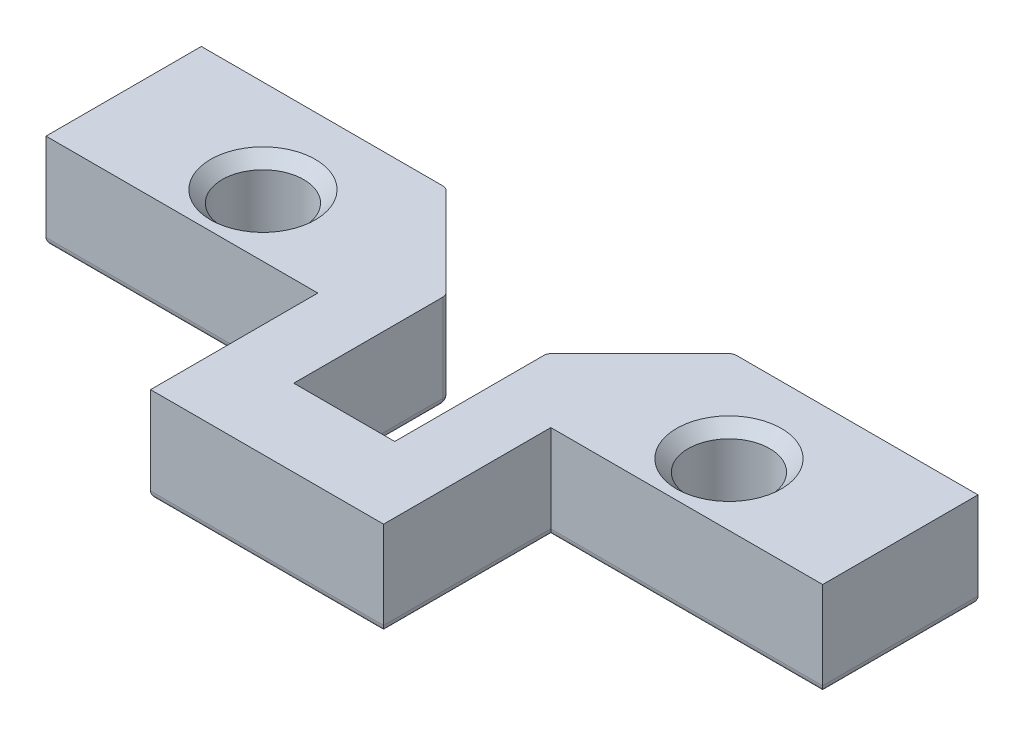
ISO-10303-21;
HEADER;
FILE_DESCRIPTION(('STEP AP214'),'2;1');
FILE_NAME('part.step','',(''),(''),'','','');
FILE_SCHEMA(('AUTOMOTIVE_DESIGN { 1 0 10303 214 1 1 1 1 }'));
ENDSEC;
DATA;
#1=APPLICATION_CONTEXT('core data for automotive mechanical design processes');
#2=APPLICATION_PROTOCOL_DEFINITION('international standard','automotive_design',2000,#1);
#3=PRODUCT_CONTEXT('',#1,'mechanical');
#4=PRODUCT('Part','Part','',(#3));
#5=PRODUCT_RELATED_PRODUCT_CATEGORY('part','',(#4));
#6=PRODUCT_DEFINITION_FORMATION('','',#4);
#7=PRODUCT_DEFINITION_CONTEXT('part definition',#1,'design');
#8=PRODUCT_DEFINITION('design','',#6,#7);
#9=PRODUCT_DEFINITION_SHAPE('','',#8);
#10=(LENGTH_UNIT() NAMED_UNIT(*) SI_UNIT(.MILLI.,.METRE.));
#11=(NAMED_UNIT(*) PLANE_ANGLE_UNIT() SI_UNIT($,.RADIAN.));
#12=(NAMED_UNIT(*) SI_UNIT($,.STERADIAN.) SOLID_ANGLE_UNIT());
#13=UNCERTAINTY_MEASURE_WITH_UNIT(LENGTH_MEASURE(1.E-05),#10,'distance_accuracy_value','');
#14=(GEOMETRIC_REPRESENTATION_CONTEXT(3) GLOBAL_UNCERTAINTY_ASSIGNED_CONTEXT((#13)) GLOBAL_UNIT_ASSIGNED_CONTEXT((#10,
#11,#12)) REPRESENTATION_CONTEXT('',''));
#15=CARTESIAN_POINT('',(0.,0.,0.));
#16=DIRECTION('',(0.,0.,1.));
#17=DIRECTION('',(1.,0.,0.));
#18=AXIS2_PLACEMENT_3D('',#15,#16,#17);
#19=CARTESIAN_POINT('',(-6.5,12.3,0.));
#20=DIRECTION('',(1.,0.,0.));
#21=DIRECTION('',(0.,0.,-1.));
#22=AXIS2_PLACEMENT_3D('',#19,#20,#21);
#23=PLANE('',#22);
#24=DIRECTION('',(0.,-1.,0.));
#25=VECTOR('',#24,1.);
#26=CARTESIAN_POINT('',(-6.5,12.3,21.6));
#27=LINE('',#26,#25);
#28=CARTESIAN_POINT('',(-6.5,12.3,21.6));
#29=VERTEX_POINT('',#28);
#30=CARTESIAN_POINT('',(-6.5,0.999999999999999,21.6));
#31=VERTEX_POINT('',#30);
#32=EDGE_CURVE('E286',#29,#31,#27,.T.);
#33=ORIENTED_EDGE('',*,*,#32,.T.);
#34=DIRECTION('',(0.,0.,1.));
#35=VECTOR('',#34,1.);
#36=CARTESIAN_POINT('',(-6.5,1.,2.00000000000003));
#37=LINE('',#36,#35);
#38=CARTESIAN_POINT('',(-6.5,1.,2.41421356237312));
#39=VERTEX_POINT('',#38);
#40=EDGE_CURVE('E401',#31,#39,#37,.F.);
#41=ORIENTED_EDGE('',*,*,#40,.T.);
#42=DIRECTION('',(0.,-1.,0.));
#43=VECTOR('',#42,1.);
#44=CARTESIAN_POINT('',(-6.5,12.3,2.41421356237312));
#45=LINE('',#44,#43);
#46=CARTESIAN_POINT('',(-6.5,12.3,2.41421356237312));
#47=VERTEX_POINT('',#46);
#48=EDGE_CURVE('E398',#39,#47,#45,.F.);
#49=ORIENTED_EDGE('',*,*,#48,.T.);
#50=DIRECTION('',(0.,0.,1.));
#51=VECTOR('',#50,1.);
#52=CARTESIAN_POINT('',(-6.5,12.3,0.));
#53=LINE('',#52,#51);
#54=EDGE_CURVE('E245',#47,#29,#53,.T.);
#55=ORIENTED_EDGE('',*,*,#54,.T.);
#56=EDGE_LOOP('',(#33,#41,#49,#55));
#57=FACE_BOUND('',#56,.T.);
#58=ADVANCED_FACE('F51',(#57),#23,.T.);
#59=CARTESIAN_POINT('',(0.,12.3,-10.));
#60=DIRECTION('',(0.,0.,-1.));
#61=DIRECTION('',(-1.,0.,0.));
#62=AXIS2_PLACEMENT_3D('',#59,#60,#61);
#63=PLANE('',#62);
#64=DIRECTION('',(0.,1.,0.));
#65=VECTOR('',#64,1.);
#66=CARTESIAN_POINT('',(-18.9142135623731,12.3,-10.));
#67=LINE('',#66,#65);
#68=CARTESIAN_POINT('',(-18.9142135623731,12.3,-10.));
#69=VERTEX_POINT('',#68);
#70=CARTESIAN_POINT('',(-18.9142135623731,1.,-10.));
#71=VERTEX_POINT('',#70);
#72=EDGE_CURVE('E422',#69,#71,#67,.F.);
#73=ORIENTED_EDGE('',*,*,#72,.T.);
#74=DIRECTION('',(1.,0.,0.));
#75=VECTOR('',#74,1.);
#76=CARTESIAN_POINT('',(-50.,1.,-10.));
#77=LINE('',#76,#75);
#78=CARTESIAN_POINT('',(-50.,0.999999999999999,-10.));
#79=VERTEX_POINT('',#78);
#80=EDGE_CURVE('E228',#71,#79,#77,.F.);
#81=ORIENTED_EDGE('',*,*,#80,.T.);
#82=DIRECTION('',(0.,-1.,0.));
#83=VECTOR('',#82,1.);
#84=CARTESIAN_POINT('',(-50.,12.3,-10.));
#85=LINE('',#84,#83);
#86=CARTESIAN_POINT('',(-50.,12.3,-10.));
#87=VERTEX_POINT('',#86);
#88=EDGE_CURVE('E222',#87,#79,#85,.T.);
#89=ORIENTED_EDGE('',*,*,#88,.F.);
#90=DIRECTION('',(1.,0.,0.));
#91=VECTOR('',#90,1.);
#92=CARTESIAN_POINT('',(0.,12.3,-10.));
#93=LINE('',#92,#91);
#94=EDGE_CURVE('E225',#87,#69,#93,.T.);
#95=ORIENTED_EDGE('',*,*,#94,.T.);
#96=EDGE_LOOP('',(#73,#81,#89,#95));
#97=FACE_BOUND('',#96,.T.);
#98=ADVANCED_FACE('F224',(#97),#63,.T.);
#99=CARTESIAN_POINT('',(-50.,12.3,0.));
#100=DIRECTION('',(-1.,0.,0.));
#101=DIRECTION('',(0.,0.,1.));
#102=AXIS2_PLACEMENT_3D('',#99,#100,#101);
#103=PLANE('',#102);
#104=ORIENTED_EDGE('',*,*,#88,.T.);
#105=DIRECTION('',(0.,0.,-1.));
#106=VECTOR('',#105,1.);
#107=CARTESIAN_POINT('',(-50.,1.,10.));
#108=LINE('',#107,#106);
#109=CARTESIAN_POINT('',(-50.,0.999999999999999,10.));
#110=VERTEX_POINT('',#109);
#111=EDGE_CURVE('E427',#79,#110,#108,.F.);
#112=ORIENTED_EDGE('',*,*,#111,.T.);
#113=DIRECTION('',(0.,-1.,0.));
#114=VECTOR('',#113,1.);
#115=CARTESIAN_POINT('',(-50.,12.3,10.));
#116=LINE('',#115,#114);
#117=CARTESIAN_POINT('',(-50.,12.3,10.));
#118=VERTEX_POINT('',#117);
#119=EDGE_CURVE('E234',#118,#110,#116,.T.);
#120=ORIENTED_EDGE('',*,*,#119,.F.);
#121=DIRECTION('',(0.,0.,-1.));
#122=VECTOR('',#121,1.);
#123=CARTESIAN_POINT('',(-50.,12.3,0.));
#124=LINE('',#123,#122);
#125=EDGE_CURVE('E241',#118,#87,#124,.T.);
#126=ORIENTED_EDGE('',*,*,#125,.T.);
#127=EDGE_LOOP('',(#104,#112,#120,#126));
#128=FACE_BOUND('',#127,.T.);
#129=ADVANCED_FACE('F247',(#128),#103,.T.);
#130=CARTESIAN_POINT('',(0.,12.3,10.));
#131=DIRECTION('',(0.,0.,-1.));
#132=DIRECTION('',(-1.,0.,0.));
#133=AXIS2_PLACEMENT_3D('',#130,#131,#132);
#134=PLANE('',#133);
#135=ORIENTED_EDGE('',*,*,#119,.T.);
#136=DIRECTION('',(1.,0.,0.));
#137=VECTOR('',#136,1.);
#138=CARTESIAN_POINT('',(0.,0.999999999999999,10.));
#139=LINE('',#138,#137);
#140=CARTESIAN_POINT('',(-15.,0.999999999999999,10.));
#141=VERTEX_POINT('',#140);
#142=EDGE_CURVE('E430',#110,#141,#139,.T.);
#143=ORIENTED_EDGE('',*,*,#142,.T.);
#144=DIRECTION('',(0.,-1.,0.));
#145=VECTOR('',#144,1.);
#146=CARTESIAN_POINT('',(-15.,12.3,10.));
#147=LINE('',#146,#145);
#148=CARTESIAN_POINT('',(-15.,12.3,10.));
#149=VERTEX_POINT('',#148);
#150=EDGE_CURVE('E323',#149,#141,#147,.T.);
#151=ORIENTED_EDGE('',*,*,#150,.F.);
#152=DIRECTION('',(1.,0.,0.));
#153=VECTOR('',#152,1.);
#154=CARTESIAN_POINT('',(0.,12.3,10.));
#155=LINE('',#154,#153);
#156=EDGE_CURVE('E251',#118,#149,#155,.T.);
#157=ORIENTED_EDGE('',*,*,#156,.F.);
#158=EDGE_LOOP('',(#135,#143,#151,#157));
#159=FACE_BOUND('',#158,.T.);
#160=ADVANCED_FACE('F576',(#159),#134,.F.);
#161=CARTESIAN_POINT('',(-15.,12.3,0.));
#162=DIRECTION('',(1.,0.,0.));
#163=DIRECTION('',(0.,0.,-1.));
#164=AXIS2_PLACEMENT_3D('',#161,#162,#163);
#165=PLANE('',#164);
#166=ORIENTED_EDGE('',*,*,#150,.T.);
#167=DIRECTION('',(0.,0.,1.));
#168=VECTOR('',#167,1.);
#169=CARTESIAN_POINT('',(-15.,0.999999999999999,0.));
#170=LINE('',#169,#168);
#171=CARTESIAN_POINT('',(-15.,0.999999999999999,31.53738907));
#172=VERTEX_POINT('',#171);
#173=EDGE_CURVE('E433',#141,#172,#170,.T.);
#174=ORIENTED_EDGE('',*,*,#173,.T.);
#175=DIRECTION('',(0.,-1.,0.));
#176=VECTOR('',#175,1.);
#177=CARTESIAN_POINT('',(-15.,12.3,31.53738907));
#178=LINE('',#177,#176);
#179=CARTESIAN_POINT('',(-15.,12.3,31.53738907));
#180=VERTEX_POINT('',#179);
#181=EDGE_CURVE('E319',#180,#172,#178,.T.);
#182=ORIENTED_EDGE('',*,*,#181,.F.);
#183=DIRECTION('',(0.,0.,1.));
#184=VECTOR('',#183,1.);
#185=CARTESIAN_POINT('',(-15.,12.3,0.));
#186=LINE('',#185,#184);
#187=EDGE_CURVE('E254',#149,#180,#186,.T.);
#188=ORIENTED_EDGE('',*,*,#187,.F.);
#189=EDGE_LOOP('',(#166,#174,#182,#188));
#190=FACE_BOUND('',#189,.T.);
#191=ADVANCED_FACE('F582',(#190),#165,.F.);
#192=CARTESIAN_POINT('',(0.,12.3,31.53738907));
#193=DIRECTION('',(0.,0.,1.));
#194=DIRECTION('',(1.,0.,0.));
#195=AXIS2_PLACEMENT_3D('',#192,#193,#194);
#196=PLANE('',#195);
#197=ORIENTED_EDGE('',*,*,#181,.T.);
#198=DIRECTION('',(-1.,0.,0.));
#199=VECTOR('',#198,1.);
#200=CARTESIAN_POINT('',(15.,1.,31.53738907));
#201=LINE('',#200,#199);
#202=CARTESIAN_POINT('',(15.,0.999999999999999,31.53738907));
#203=VERTEX_POINT('',#202);
#204=EDGE_CURVE('E436',#172,#203,#201,.F.);
#205=ORIENTED_EDGE('',*,*,#204,.T.);
#206=DIRECTION('',(0.,-1.,0.));
#207=VECTOR('',#206,1.);
#208=CARTESIAN_POINT('',(15.,12.3,31.53738907));
#209=LINE('',#208,#207);
#210=CARTESIAN_POINT('',(15.,12.3,31.53738907));
#211=VERTEX_POINT('',#210);
#212=EDGE_CURVE('E315',#211,#203,#209,.T.);
#213=ORIENTED_EDGE('',*,*,#212,.F.);
#214=DIRECTION('',(-1.,0.,0.));
#215=VECTOR('',#214,1.);
#216=CARTESIAN_POINT('',(0.,12.3,31.53738907));
#217=LINE('',#216,#215);
#218=EDGE_CURVE('E260',#211,#180,#217,.T.);
#219=ORIENTED_EDGE('',*,*,#218,.T.);
#220=EDGE_LOOP('',(#197,#205,#213,#219));
#221=FACE_BOUND('',#220,.T.);
#222=ADVANCED_FACE('F586',(#221),#196,.T.);
#223=CARTESIAN_POINT('',(15.,12.3,0.));
#224=DIRECTION('',(1.,0.,0.));
#225=DIRECTION('',(0.,0.,-1.));
#226=AXIS2_PLACEMENT_3D('',#223,#224,#225);
#227=PLANE('',#226);
#228=ORIENTED_EDGE('',*,*,#212,.T.);
#229=DIRECTION('',(0.,0.,1.));
#230=VECTOR('',#229,1.);
#231=CARTESIAN_POINT('',(15.,1.,10.));
#232=LINE('',#231,#230);
#233=CARTESIAN_POINT('',(15.,0.999999999999999,10.));
#234=VERTEX_POINT('',#233);
#235=EDGE_CURVE('E439',#203,#234,#232,.F.);
#236=ORIENTED_EDGE('',*,*,#235,.T.);
#237=DIRECTION('',(0.,-1.,0.));
#238=VECTOR('',#237,1.);
#239=CARTESIAN_POINT('',(15.,12.3,10.));
#240=LINE('',#239,#238);
#241=CARTESIAN_POINT('',(15.,12.3,10.));
#242=VERTEX_POINT('',#241);
#243=EDGE_CURVE('E311',#242,#234,#240,.T.);
#244=ORIENTED_EDGE('',*,*,#243,.F.);
#245=DIRECTION('',(0.,0.,1.));
#246=VECTOR('',#245,1.);
#247=CARTESIAN_POINT('',(15.,12.3,0.));
#248=LINE('',#247,#246);
#249=EDGE_CURVE('E264',#242,#211,#248,.T.);
#250=ORIENTED_EDGE('',*,*,#249,.T.);
#251=EDGE_LOOP('',(#228,#236,#244,#250));
#252=FACE_BOUND('',#251,.T.);
#253=ADVANCED_FACE('F590',(#252),#227,.T.);
#254=CARTESIAN_POINT('',(0.,12.3,10.));
#255=DIRECTION('',(0.,0.,-1.));
#256=DIRECTION('',(-1.,0.,0.));
#257=AXIS2_PLACEMENT_3D('',#254,#255,#256);
#258=PLANE('',#257);
#259=ORIENTED_EDGE('',*,*,#243,.T.);
#260=DIRECTION('',(1.,0.,0.));
#261=VECTOR('',#260,1.);
#262=CARTESIAN_POINT('',(0.,0.999999999999999,10.));
#263=LINE('',#262,#261);
#264=CARTESIAN_POINT('',(50.,0.999999999999999,10.));
#265=VERTEX_POINT('',#264);
#266=EDGE_CURVE('E442',#234,#265,#263,.T.);
#267=ORIENTED_EDGE('',*,*,#266,.T.);
#268=DIRECTION('',(0.,-1.,0.));
#269=VECTOR('',#268,1.);
#270=CARTESIAN_POINT('',(50.,12.3,10.));
#271=LINE('',#270,#269);
#272=CARTESIAN_POINT('',(50.,12.3,10.));
#273=VERTEX_POINT('',#272);
#274=EDGE_CURVE('E308',#273,#265,#271,.T.);
#275=ORIENTED_EDGE('',*,*,#274,.F.);
#276=DIRECTION('',(1.,0.,0.));
#277=VECTOR('',#276,1.);
#278=CARTESIAN_POINT('',(0.,12.3,10.));
#279=LINE('',#278,#277);
#280=EDGE_CURVE('E268',#242,#273,#279,.T.);
#281=ORIENTED_EDGE('',*,*,#280,.F.);
#282=EDGE_LOOP('',(#259,#267,#275,#281));
#283=FACE_BOUND('',#282,.T.);
#284=ADVANCED_FACE('F606',(#283),#258,.F.);
#285=CARTESIAN_POINT('',(50.,12.3,0.));
#286=DIRECTION('',(-1.,0.,0.));
#287=DIRECTION('',(0.,0.,1.));
#288=AXIS2_PLACEMENT_3D('',#285,#286,#287);
#289=PLANE('',#288);
#290=ORIENTED_EDGE('',*,*,#274,.T.);
#291=DIRECTION('',(0.,0.,-1.));
#292=VECTOR('',#291,1.);
#293=CARTESIAN_POINT('',(50.,0.999999999999999,0.));
#294=LINE('',#293,#292);
#295=CARTESIAN_POINT('',(50.,0.999999999999999,-10.));
#296=VERTEX_POINT('',#295);
#297=EDGE_CURVE('E77',#265,#296,#294,.T.);
#298=ORIENTED_EDGE('',*,*,#297,.T.);
#299=DIRECTION('',(0.,-1.,0.));
#300=VECTOR('',#299,1.);
#301=CARTESIAN_POINT('',(50.,12.3,-10.));
#302=LINE('',#301,#300);
#303=CARTESIAN_POINT('',(50.,12.3,-10.));
#304=VERTEX_POINT('',#303);
#305=EDGE_CURVE('E305',#304,#296,#302,.T.);
#306=ORIENTED_EDGE('',*,*,#305,.F.);
#307=DIRECTION('',(0.,0.,-1.));
#308=VECTOR('',#307,1.);
#309=CARTESIAN_POINT('',(50.,12.3,0.));
#310=LINE('',#309,#308);
#311=EDGE_CURVE('E272',#273,#304,#310,.T.);
#312=ORIENTED_EDGE('',*,*,#311,.F.);
#313=EDGE_LOOP('',(#290,#298,#306,#312));
#314=FACE_BOUND('',#313,.T.);
#315=ADVANCED_FACE('F608',(#314),#289,.F.);
#316=CARTESIAN_POINT('',(0.,12.3,-10.));
#317=DIRECTION('',(0.,0.,-1.));
#318=DIRECTION('',(-1.,0.,0.));
#319=AXIS2_PLACEMENT_3D('',#316,#317,#318);
#320=PLANE('',#319);
#321=DIRECTION('',(1.,0.,0.));
#322=VECTOR('',#321,1.);
#323=CARTESIAN_POINT('',(18.5,1.,-10.));
#324=LINE('',#323,#322);
#325=CARTESIAN_POINT('',(18.9142135623731,1.,-10.));
#326=VERTEX_POINT('',#325);
#327=EDGE_CURVE('E69',#296,#326,#324,.F.);
#328=ORIENTED_EDGE('',*,*,#327,.T.);
#329=DIRECTION('',(0.,1.,0.));
#330=VECTOR('',#329,1.);
#331=CARTESIAN_POINT('',(18.9142135623731,12.3,-10.));
#332=LINE('',#331,#330);
#333=CARTESIAN_POINT('',(18.9142135623731,12.3,-10.));
#334=VERTEX_POINT('',#333);
#335=EDGE_CURVE('E458',#326,#334,#332,.T.);
#336=ORIENTED_EDGE('',*,*,#335,.T.);
#337=DIRECTION('',(1.,0.,0.));
#338=VECTOR('',#337,1.);
#339=CARTESIAN_POINT('',(0.,12.3,-10.));
#340=LINE('',#339,#338);
#341=EDGE_CURVE('E276',#334,#304,#340,.T.);
#342=ORIENTED_EDGE('',*,*,#341,.T.);
#343=ORIENTED_EDGE('',*,*,#305,.T.);
#344=EDGE_LOOP('',(#328,#336,#342,#343));
#345=FACE_BOUND('',#344,.T.);
#346=ADVANCED_FACE('F925',(#345),#320,.T.);
#347=CARTESIAN_POINT('',(6.5,12.3,0.));
#348=DIRECTION('',(1.,0.,0.));
#349=DIRECTION('',(0.,0.,-1.));
#350=AXIS2_PLACEMENT_3D('',#347,#348,#349);
#351=PLANE('',#350);
#352=DIRECTION('',(0.,-1.,0.));
#353=VECTOR('',#352,1.);
#354=CARTESIAN_POINT('',(6.5,0.,2.41421356237308));
#355=LINE('',#354,#353);
#356=CARTESIAN_POINT('',(6.5,12.3,2.41421356237308));
#357=VERTEX_POINT('',#356);
#358=CARTESIAN_POINT('',(6.5,0.999999999999999,2.41421356237308));
#359=VERTEX_POINT('',#358);
#360=EDGE_CURVE('E351',#357,#359,#355,.T.);
#361=ORIENTED_EDGE('',*,*,#360,.T.);
#362=DIRECTION('',(0.,0.,1.));
#363=VECTOR('',#362,1.);
#364=CARTESIAN_POINT('',(6.5,0.999999999999999,0.));
#365=LINE('',#364,#363);
#366=CARTESIAN_POINT('',(6.5,0.999999999999999,21.6));
#367=VERTEX_POINT('',#366);
#368=EDGE_CURVE('E354',#359,#367,#365,.T.);
#369=ORIENTED_EDGE('',*,*,#368,.T.);
#370=DIRECTION('',(0.,-1.,0.));
#371=VECTOR('',#370,1.);
#372=CARTESIAN_POINT('',(6.5,12.3,21.6));
#373=LINE('',#372,#371);
#374=CARTESIAN_POINT('',(6.5,12.3,21.6));
#375=VERTEX_POINT('',#374);
#376=EDGE_CURVE('E301',#375,#367,#373,.T.);
#377=ORIENTED_EDGE('',*,*,#376,.F.);
#378=DIRECTION('',(0.,0.,1.));
#379=VECTOR('',#378,1.);
#380=CARTESIAN_POINT('',(6.5,12.3,0.));
#381=LINE('',#380,#379);
#382=EDGE_CURVE('E279',#357,#375,#381,.T.);
#383=ORIENTED_EDGE('',*,*,#382,.F.);
#384=EDGE_LOOP('',(#361,#369,#377,#383));
#385=FACE_BOUND('',#384,.T.);
#386=ADVANCED_FACE('F631',(#385),#351,.F.);
#387=CARTESIAN_POINT('',(0.,12.3,21.6));
#388=DIRECTION('',(0.,0.,-1.));
#389=DIRECTION('',(-1.,0.,0.));
#390=AXIS2_PLACEMENT_3D('',#387,#388,#389);
#391=PLANE('',#390);
#392=DIRECTION('',(1.,0.,0.));
#393=VECTOR('',#392,1.);
#394=CARTESIAN_POINT('',(0.,0.,21.6));
#395=LINE('',#394,#393);
#396=CARTESIAN_POINT('',(-7.5,0.,21.6));
#397=VERTEX_POINT('',#396);
#398=CARTESIAN_POINT('',(7.5,0.,21.6));
#399=VERTEX_POINT('',#398);
#400=EDGE_CURVE('E291',#397,#399,#395,.T.);
#401=ORIENTED_EDGE('',*,*,#400,.F.);
#402=CARTESIAN_POINT('',(-7.5,1.,21.6));
#403=DIRECTION('',(0.,0.,-1.));
#404=DIRECTION('',(-1.,0.,0.));
#405=AXIS2_PLACEMENT_3D('',#402,#403,#404);
#406=CIRCLE('',#405,1.);
#407=EDGE_CURVE('E11',#397,#31,#406,.F.);
#408=ORIENTED_EDGE('',*,*,#407,.T.);
#409=ORIENTED_EDGE('',*,*,#32,.F.);
#410=DIRECTION('',(1.,0.,0.));
#411=VECTOR('',#410,1.);
#412=CARTESIAN_POINT('',(0.,12.3,21.6));
#413=LINE('',#412,#411);
#414=EDGE_CURVE('E282',#29,#375,#413,.T.);
#415=ORIENTED_EDGE('',*,*,#414,.T.);
#416=ORIENTED_EDGE('',*,*,#376,.T.);
#417=CARTESIAN_POINT('',(7.5,0.999999999999999,21.6));
#418=DIRECTION('',(0.,0.,-1.));
#419=DIRECTION('',(-1.,0.,0.));
#420=AXIS2_PLACEMENT_3D('',#417,#418,#419);
#421=CIRCLE('',#420,1.);
#422=EDGE_CURVE('E61',#367,#399,#421,.F.);
#423=ORIENTED_EDGE('',*,*,#422,.T.);
#424=EDGE_LOOP('',(#401,#408,#409,#415,#416,#423));
#425=FACE_BOUND('',#424,.T.);
#426=ADVANCED_FACE('F639',(#425),#391,.T.);
#427=CARTESIAN_POINT('',(-30.0667409058085,12.3,2.));
#428=DIRECTION('',(0.,-1.,0.));
#429=DIRECTION('',(0.,0.,-1.));
#430=AXIS2_PLACEMENT_3D('',#427,#428,#429);
#431=CYLINDRICAL_SURFACE('',#430,5.25);
#432=CARTESIAN_POINT('',(-30.0667409058085,10.8,2.));
#433=DIRECTION('',(0.,1.,0.));
#434=DIRECTION('',(0.,0.,1.));
#435=AXIS2_PLACEMENT_3D('',#432,#433,#434);
#436=CIRCLE('',#435,5.25);
#437=CARTESIAN_POINT('',(-30.0667409058085,10.8,7.25));
#438=VERTEX_POINT('',#437);
#439=EDGE_CURVE('E340',#438,#438,#436,.T.);
#440=ORIENTED_EDGE('',*,*,#439,.T.);
#441=EDGE_LOOP('',(#440));
#442=FACE_BOUND('',#441,.T.);
#443=CARTESIAN_POINT('',(-30.0667409058085,0.,2.));
#444=DIRECTION('',(0.,1.,0.));
#445=DIRECTION('',(0.,0.,1.));
#446=AXIS2_PLACEMENT_3D('',#443,#444,#445);
#447=CIRCLE('',#446,5.25);
#448=CARTESIAN_POINT('',(-30.0667409058085,0.,7.25));
#449=VERTEX_POINT('',#448);
#450=EDGE_CURVE('E287',#449,#449,#447,.T.);
#451=ORIENTED_EDGE('',*,*,#450,.F.);
#452=EDGE_LOOP('',(#451));
#453=FACE_BOUND('',#452,.T.);
#454=ADVANCED_FACE('F686',(#442,#453),#431,.F.);
#455=CARTESIAN_POINT('',(29.9332590941915,12.3,2.));
#456=DIRECTION('',(0.,-1.,0.));
#457=DIRECTION('',(0.,0.,-1.));
#458=AXIS2_PLACEMENT_3D('',#455,#456,#457);
#459=CYLINDRICAL_SURFACE('',#458,5.25);
#460=CARTESIAN_POINT('',(29.9332590941915,10.8,2.));
#461=DIRECTION('',(0.,1.,0.));
#462=DIRECTION('',(0.,0.,1.));
#463=AXIS2_PLACEMENT_3D('',#460,#461,#462);
#464=CIRCLE('',#463,5.25);
#465=CARTESIAN_POINT('',(29.9332590941915,10.8,7.25));
#466=VERTEX_POINT('',#465);
#467=EDGE_CURVE('E233',#466,#466,#464,.T.);
#468=ORIENTED_EDGE('',*,*,#467,.T.);
#469=EDGE_LOOP('',(#468));
#470=FACE_BOUND('',#469,.T.);
#471=CARTESIAN_POINT('',(29.9332590941915,0.,2.));
#472=DIRECTION('',(0.,1.,0.));
#473=DIRECTION('',(0.,0.,1.));
#474=AXIS2_PLACEMENT_3D('',#471,#472,#473);
#475=CIRCLE('',#474,5.25);
#476=CARTESIAN_POINT('',(29.9332590941915,0.,7.25));
#477=VERTEX_POINT('',#476);
#478=EDGE_CURVE('E294',#477,#477,#475,.T.);
#479=ORIENTED_EDGE('',*,*,#478,.F.);
#480=EDGE_LOOP('',(#479));
#481=FACE_BOUND('',#480,.T.);
#482=ADVANCED_FACE('F689',(#470,#481),#459,.F.);
#483=CARTESIAN_POINT('',(0.,12.3,0.));
#484=DIRECTION('',(0.,1.,0.));
#485=DIRECTION('',(0.,0.,1.));
#486=AXIS2_PLACEMENT_3D('',#483,#484,#485);
#487=PLANE('',#486);
#488=CARTESIAN_POINT('',(29.9332590941915,12.3,2.));
#489=DIRECTION('',(0.,1.,0.));
#490=DIRECTION('',(0.,0.,1.));
#491=AXIS2_PLACEMENT_3D('',#488,#489,#490);
#492=CIRCLE('',#491,6.75000000000001);
#493=CARTESIAN_POINT('',(29.9332590941915,12.3,8.75));
#494=VERTEX_POINT('',#493);
#495=EDGE_CURVE('E336',#494,#494,#492,.F.);
#496=ORIENTED_EDGE('',*,*,#495,.T.);
#497=EDGE_LOOP('',(#496));
#498=FACE_BOUND('',#497,.T.);
#499=CARTESIAN_POINT('',(-30.0667409058085,12.3,2.));
#500=DIRECTION('',(0.,1.,0.));
#501=DIRECTION('',(0.,0.,1.));
#502=AXIS2_PLACEMENT_3D('',#499,#500,#501);
#503=CIRCLE('',#502,6.75000000000001);
#504=CARTESIAN_POINT('',(-30.0667409058085,12.3,8.75));
#505=VERTEX_POINT('',#504);
#506=EDGE_CURVE('E332',#505,#505,#503,.F.);
#507=ORIENTED_EDGE('',*,*,#506,.T.);
#508=EDGE_LOOP('',(#507));
#509=FACE_BOUND('',#508,.T.);
#510=DIRECTION('',(0.707106781186546,0.,0.707106781186549));
#511=VECTOR('',#510,1.);
#512=CARTESIAN_POINT('',(-4.25000000000002,12.3,4.25000000000001));
#513=LINE('',#512,#511);
#514=CARTESIAN_POINT('',(-6.79289321881345,12.3,1.70710678118657));
#515=VERTEX_POINT('',#514);
#516=CARTESIAN_POINT('',(-18.2071067811865,12.3,-9.70710678118655));
#517=VERTEX_POINT('',#516);
#518=EDGE_CURVE('E348',#515,#517,#513,.F.);
#519=ORIENTED_EDGE('',*,*,#518,.T.);
#520=CARTESIAN_POINT('',(-18.9142135623731,12.3,-9.));
#521=DIRECTION('',(0.,1.,0.));
#522=DIRECTION('',(0.,0.,1.));
#523=AXIS2_PLACEMENT_3D('',#520,#521,#522);
#524=CIRCLE('',#523,1.);
#525=EDGE_CURVE('E243',#517,#69,#524,.T.);
#526=ORIENTED_EDGE('',*,*,#525,.T.);
#527=ORIENTED_EDGE('',*,*,#94,.F.);
#528=ORIENTED_EDGE('',*,*,#125,.F.);
#529=ORIENTED_EDGE('',*,*,#156,.T.);
#530=ORIENTED_EDGE('',*,*,#187,.T.);
#531=ORIENTED_EDGE('',*,*,#218,.F.);
#532=ORIENTED_EDGE('',*,*,#249,.F.);
#533=ORIENTED_EDGE('',*,*,#280,.T.);
#534=ORIENTED_EDGE('',*,*,#311,.T.);
#535=ORIENTED_EDGE('',*,*,#341,.F.);
#536=CARTESIAN_POINT('',(18.9142135623731,12.3,-9.));
#537=DIRECTION('',(0.,1.,0.));
#538=DIRECTION('',(0.,0.,1.));
#539=AXIS2_PLACEMENT_3D('',#536,#537,#538);
#540=CIRCLE('',#539,1.);
#541=CARTESIAN_POINT('',(18.2071067811866,12.3,-9.70710678118655));
#542=VERTEX_POINT('',#541);
#543=EDGE_CURVE('E445',#334,#542,#540,.T.);
#544=ORIENTED_EDGE('',*,*,#543,.T.);
#545=DIRECTION('',(-0.707106781186549,0.,0.707106781186546));
#546=VECTOR('',#545,1.);
#547=CARTESIAN_POINT('',(4.24999999999998,12.3,4.24999999999999));
#548=LINE('',#547,#546);
#549=CARTESIAN_POINT('',(6.79289321881345,12.3,1.70710678118653));
#550=VERTEX_POINT('',#549);
#551=EDGE_CURVE('E344',#542,#550,#548,.T.);
#552=ORIENTED_EDGE('',*,*,#551,.T.);
#553=CARTESIAN_POINT('',(7.5,12.3,2.41421356237308));
#554=DIRECTION('',(0.,1.,0.));
#555=DIRECTION('',(0.,0.,1.));
#556=AXIS2_PLACEMENT_3D('',#553,#554,#555);
#557=CIRCLE('',#556,1.);
#558=EDGE_CURVE('E448',#550,#357,#557,.T.);
#559=ORIENTED_EDGE('',*,*,#558,.T.);
#560=ORIENTED_EDGE('',*,*,#382,.T.);
#561=ORIENTED_EDGE('',*,*,#414,.F.);
#562=ORIENTED_EDGE('',*,*,#54,.F.);
#563=CARTESIAN_POINT('',(-7.5,12.3,2.41421356237312));
#564=DIRECTION('',(0.,1.,0.));
#565=DIRECTION('',(0.,0.,1.));
#566=AXIS2_PLACEMENT_3D('',#563,#564,#565);
#567=CIRCLE('',#566,1.);
#568=EDGE_CURVE('E451',#47,#515,#567,.T.);
#569=ORIENTED_EDGE('',*,*,#568,.T.);
#570=EDGE_LOOP('',(#519,#526,#527,#528,#529,#530,#531,#532,#533,#534,#535,#544,#552,#559,#560,
#561,#562,#569));
#571=FACE_BOUND('',#570,.T.);
#572=ADVANCED_FACE('F239',(#498,#509,#571),#487,.T.);
#573=CARTESIAN_POINT('',(0.,0.,0.));
#574=DIRECTION('',(0.,1.,0.));
#575=DIRECTION('',(0.,0.,1.));
#576=AXIS2_PLACEMENT_3D('',#573,#574,#575);
#577=PLANE('',#576);
#578=ORIENTED_EDGE('',*,*,#450,.T.);
#579=EDGE_LOOP('',(#578));
#580=FACE_BOUND('',#579,.T.);
#581=DIRECTION('',(0.,0.,1.));
#582=VECTOR('',#581,1.);
#583=CARTESIAN_POINT('',(-7.5,0.,21.6));
#584=LINE('',#583,#582);
#585=CARTESIAN_POINT('',(-7.5,0.,2.41421356237312));
#586=VERTEX_POINT('',#585);
#587=EDGE_CURVE('E391',#586,#397,#584,.T.);
#588=ORIENTED_EDGE('',*,*,#587,.T.);
#589=ORIENTED_EDGE('',*,*,#400,.T.);
#590=DIRECTION('',(0.,0.,1.));
#591=VECTOR('',#590,1.);
#592=CARTESIAN_POINT('',(7.5,0.,0.));
#593=LINE('',#592,#591);
#594=CARTESIAN_POINT('',(7.5,0.,2.41421356237308));
#595=VERTEX_POINT('',#594);
#596=EDGE_CURVE('E395',#399,#595,#593,.F.);
#597=ORIENTED_EDGE('',*,*,#596,.T.);
#598=DIRECTION('',(0.707106781186549,0.,-0.707106781186546));
#599=VECTOR('',#598,1.);
#600=CARTESIAN_POINT('',(19.2071067811866,0.,-9.29289321881345));
#601=LINE('',#600,#599);
#602=CARTESIAN_POINT('',(18.9142135623731,0.,-9.));
#603=VERTEX_POINT('',#602);
#604=EDGE_CURVE('E388',#595,#603,#601,.T.);
#605=ORIENTED_EDGE('',*,*,#604,.T.);
#606=DIRECTION('',(1.,0.,0.));
#607=VECTOR('',#606,1.);
#608=CARTESIAN_POINT('',(50.,0.,-9.));
#609=LINE('',#608,#607);
#610=CARTESIAN_POINT('',(49.,0.,-9.));
#611=VERTEX_POINT('',#610);
#612=EDGE_CURVE('E358',#603,#611,#609,.T.);
#613=ORIENTED_EDGE('',*,*,#612,.T.);
#614=DIRECTION('',(0.,0.,-1.));
#615=VECTOR('',#614,1.);
#616=CARTESIAN_POINT('',(49.,0.,0.));
#617=LINE('',#616,#615);
#618=CARTESIAN_POINT('',(49.,0.,9.));
#619=VERTEX_POINT('',#618);
#620=EDGE_CURVE('E361',#611,#619,#617,.F.);
#621=ORIENTED_EDGE('',*,*,#620,.T.);
#622=DIRECTION('',(1.,0.,0.));
#623=VECTOR('',#622,1.);
#624=CARTESIAN_POINT('',(0.,0.,9.));
#625=LINE('',#624,#623);
#626=CARTESIAN_POINT('',(14.,0.,9.));
#627=VERTEX_POINT('',#626);
#628=EDGE_CURVE('E364',#619,#627,#625,.F.);
#629=ORIENTED_EDGE('',*,*,#628,.T.);
#630=DIRECTION('',(0.,0.,1.));
#631=VECTOR('',#630,1.);
#632=CARTESIAN_POINT('',(14.,0.,31.53738907));
#633=LINE('',#632,#631);
#634=CARTESIAN_POINT('',(14.,0.,30.53738907));
#635=VERTEX_POINT('',#634);
#636=EDGE_CURVE('E367',#627,#635,#633,.T.);
#637=ORIENTED_EDGE('',*,*,#636,.T.);
#638=DIRECTION('',(-1.,0.,0.));
#639=VECTOR('',#638,1.);
#640=CARTESIAN_POINT('',(-15.,0.,30.53738907));
#641=LINE('',#640,#639);
#642=CARTESIAN_POINT('',(-14.,0.,30.53738907));
#643=VERTEX_POINT('',#642);
#644=EDGE_CURVE('E370',#635,#643,#641,.T.);
#645=ORIENTED_EDGE('',*,*,#644,.T.);
#646=DIRECTION('',(0.,0.,1.));
#647=VECTOR('',#646,1.);
#648=CARTESIAN_POINT('',(-14.,0.,0.));
#649=LINE('',#648,#647);
#650=CARTESIAN_POINT('',(-14.,0.,9.));
#651=VERTEX_POINT('',#650);
#652=EDGE_CURVE('E373',#643,#651,#649,.F.);
#653=ORIENTED_EDGE('',*,*,#652,.T.);
#654=DIRECTION('',(1.,0.,0.));
#655=VECTOR('',#654,1.);
#656=CARTESIAN_POINT('',(0.,0.,9.));
#657=LINE('',#656,#655);
#658=CARTESIAN_POINT('',(-49.,0.,9.));
#659=VERTEX_POINT('',#658);
#660=EDGE_CURVE('E376',#651,#659,#657,.F.);
#661=ORIENTED_EDGE('',*,*,#660,.T.);
#662=DIRECTION('',(0.,0.,-1.));
#663=VECTOR('',#662,1.);
#664=CARTESIAN_POINT('',(-49.,0.,-10.));
#665=LINE('',#664,#663);
#666=CARTESIAN_POINT('',(-49.,0.,-9.));
#667=VERTEX_POINT('',#666);
#668=EDGE_CURVE('E379',#659,#667,#665,.T.);
#669=ORIENTED_EDGE('',*,*,#668,.T.);
#670=DIRECTION('',(1.,0.,0.));
#671=VECTOR('',#670,1.);
#672=CARTESIAN_POINT('',(-18.5,0.,-9.));
#673=LINE('',#672,#671);
#674=CARTESIAN_POINT('',(-18.9142135623731,0.,-9.));
#675=VERTEX_POINT('',#674);
#676=EDGE_CURVE('E382',#667,#675,#673,.T.);
#677=ORIENTED_EDGE('',*,*,#676,.T.);
#678=DIRECTION('',(-0.707106781186546,0.,-0.707106781186549));
#679=VECTOR('',#678,1.);
#680=CARTESIAN_POINT('',(-7.20710678118655,0.,2.70710678118657));
#681=LINE('',#680,#679);
#682=EDGE_CURVE('E385',#675,#586,#681,.F.);
#683=ORIENTED_EDGE('',*,*,#682,.T.);
#684=EDGE_LOOP('',(#588,#589,#597,#605,#613,#621,#629,#637,#645,#653,#661,#669,#677,#683));
#685=FACE_BOUND('',#684,.T.);
#686=ORIENTED_EDGE('',*,*,#478,.T.);
#687=EDGE_LOOP('',(#686));
#688=FACE_BOUND('',#687,.T.);
#689=ADVANCED_FACE('F644',(#580,#685,#688),#577,.F.);
#690=CARTESIAN_POINT('',(29.9332590941915,10.8,2.));
#691=DIRECTION('',(0.,1.,0.));
#692=DIRECTION('',(0.,0.,1.));
#693=AXIS2_PLACEMENT_3D('',#690,#691,#692);
#694=CONICAL_SURFACE('',#693,5.25,0.785398163397446);
#695=ORIENTED_EDGE('',*,*,#495,.F.);
#696=EDGE_LOOP('',(#695));
#697=FACE_BOUND('',#696,.T.);
#698=ORIENTED_EDGE('',*,*,#467,.F.);
#699=EDGE_LOOP('',(#698));
#700=FACE_BOUND('',#699,.T.);
#701=ADVANCED_FACE('F692',(#697,#700),#694,.F.);
#702=CARTESIAN_POINT('',(-30.0667409058085,10.8,2.));
#703=DIRECTION('',(0.,1.,0.));
#704=DIRECTION('',(0.,0.,1.));
#705=AXIS2_PLACEMENT_3D('',#702,#703,#704);
#706=CONICAL_SURFACE('',#705,5.25,0.785398163397446);
#707=ORIENTED_EDGE('',*,*,#506,.F.);
#708=EDGE_LOOP('',(#707));
#709=FACE_BOUND('',#708,.T.);
#710=ORIENTED_EDGE('',*,*,#439,.F.);
#711=EDGE_LOOP('',(#710));
#712=FACE_BOUND('',#711,.T.);
#713=ADVANCED_FACE('F698',(#709,#712),#706,.F.);
#714=CARTESIAN_POINT('',(-18.5,12.3,-10.));
#715=DIRECTION('',(-0.707106781186549,0.,0.707106781186546));
#716=DIRECTION('',(0.,-1.,0.));
#717=AXIS2_PLACEMENT_3D('',#714,#715,#716);
#718=PLANE('',#717);
#719=DIRECTION('',(0.707106781186546,0.,0.707106781186549));
#720=VECTOR('',#719,1.);
#721=CARTESIAN_POINT('',(-18.5,1.,-10.));
#722=LINE('',#721,#720);
#723=CARTESIAN_POINT('',(-6.79289321881345,1.,1.70710678118657));
#724=VERTEX_POINT('',#723);
#725=CARTESIAN_POINT('',(-18.2071067811865,1.,-9.70710678118655));
#726=VERTEX_POINT('',#725);
#727=EDGE_CURVE('E416',#724,#726,#722,.F.);
#728=ORIENTED_EDGE('',*,*,#727,.T.);
#729=DIRECTION('',(0.,-1.,0.));
#730=VECTOR('',#729,1.);
#731=CARTESIAN_POINT('',(-18.2071067811865,12.3,-9.70710678118655));
#732=LINE('',#731,#730);
#733=EDGE_CURVE('E419',#726,#517,#732,.F.);
#734=ORIENTED_EDGE('',*,*,#733,.T.);
#735=ORIENTED_EDGE('',*,*,#518,.F.);
#736=DIRECTION('',(0.,1.,0.));
#737=VECTOR('',#736,1.);
#738=CARTESIAN_POINT('',(-6.79289321881345,12.3,1.70710678118657));
#739=LINE('',#738,#737);
#740=EDGE_CURVE('E413',#515,#724,#739,.F.);
#741=ORIENTED_EDGE('',*,*,#740,.T.);
#742=EDGE_LOOP('',(#728,#734,#735,#741));
#743=FACE_BOUND('',#742,.T.);
#744=ADVANCED_FACE('F557',(#743),#718,.F.);
#745=CARTESIAN_POINT('',(6.5,12.3,1.99999999999998));
#746=DIRECTION('',(-0.707106781186546,0.,-0.707106781186549));
#747=DIRECTION('',(0.,1.,0.));
#748=AXIS2_PLACEMENT_3D('',#745,#746,#747);
#749=PLANE('',#748);
#750=DIRECTION('',(0.707106781186549,0.,-0.707106781186546));
#751=VECTOR('',#750,1.);
#752=CARTESIAN_POINT('',(6.5,1.,1.99999999999998));
#753=LINE('',#752,#751);
#754=CARTESIAN_POINT('',(18.2071067811866,1.,-9.70710678118655));
#755=VERTEX_POINT('',#754);
#756=CARTESIAN_POINT('',(6.79289321881345,1.,1.70710678118653));
#757=VERTEX_POINT('',#756);
#758=EDGE_CURVE('E407',#755,#757,#753,.F.);
#759=ORIENTED_EDGE('',*,*,#758,.T.);
#760=DIRECTION('',(0.,-1.,0.));
#761=VECTOR('',#760,1.);
#762=CARTESIAN_POINT('',(6.79289321881345,12.3,1.70710678118653));
#763=LINE('',#762,#761);
#764=EDGE_CURVE('E410',#757,#550,#763,.F.);
#765=ORIENTED_EDGE('',*,*,#764,.T.);
#766=ORIENTED_EDGE('',*,*,#551,.F.);
#767=DIRECTION('',(0.,1.,0.));
#768=VECTOR('',#767,1.);
#769=CARTESIAN_POINT('',(18.2071067811866,12.3,-9.70710678118655));
#770=LINE('',#769,#768);
#771=EDGE_CURVE('E404',#542,#755,#770,.F.);
#772=ORIENTED_EDGE('',*,*,#771,.T.);
#773=EDGE_LOOP('',(#759,#765,#766,#772));
#774=FACE_BOUND('',#773,.T.);
#775=ADVANCED_FACE('F619',(#774),#749,.T.);
#776=CARTESIAN_POINT('',(-7.5,1.,0.));
#777=DIRECTION('',(0.,0.,-1.));
#778=DIRECTION('',(-1.,0.,0.));
#779=AXIS2_PLACEMENT_3D('',#776,#777,#778);
#780=CYLINDRICAL_SURFACE('',#779,1.);
#781=ORIENTED_EDGE('',*,*,#407,.F.);
#782=ORIENTED_EDGE('',*,*,#587,.F.);
#783=CARTESIAN_POINT('',(-7.5,1.,2.41421356237312));
#784=DIRECTION('',(0.,0.,-1.));
#785=DIRECTION('',(0.,1.,0.));
#786=AXIS2_PLACEMENT_3D('',#783,#784,#785);
#787=CIRCLE('',#786,1.);
#788=EDGE_CURVE('E55',#39,#586,#787,.T.);
#789=ORIENTED_EDGE('',*,*,#788,.F.);
#790=ORIENTED_EDGE('',*,*,#40,.F.);
#791=EDGE_LOOP('',(#781,#782,#789,#790));
#792=FACE_BOUND('',#791,.T.);
#793=ADVANCED_FACE('F53',(#792),#780,.T.);
#794=CARTESIAN_POINT('',(-7.5,12.3,2.41421356237312));
#795=DIRECTION('',(0.,-1.,0.));
#796=DIRECTION('',(0.,0.,-1.));
#797=AXIS2_PLACEMENT_3D('',#794,#795,#796);
#798=CYLINDRICAL_SURFACE('',#797,1.);
#799=ORIENTED_EDGE('',*,*,#568,.F.);
#800=ORIENTED_EDGE('',*,*,#48,.F.);
#801=CARTESIAN_POINT('',(-7.5,1.,2.41421356237312));
#802=DIRECTION('',(0.,-1.,0.));
#803=DIRECTION('',(0.,0.,-1.));
#804=AXIS2_PLACEMENT_3D('',#801,#802,#803);
#805=CIRCLE('',#804,1.);
#806=EDGE_CURVE('E537',#724,#39,#805,.T.);
#807=ORIENTED_EDGE('',*,*,#806,.F.);
#808=ORIENTED_EDGE('',*,*,#740,.F.);
#809=EDGE_LOOP('',(#799,#800,#807,#808));
#810=FACE_BOUND('',#809,.T.);
#811=ADVANCED_FACE('F715',(#810),#798,.T.);
#812=CARTESIAN_POINT('',(-7.5,1.,2.41421356237312));
#813=DIRECTION('',(0.,-1.,0.));
#814=DIRECTION('',(1.,0.,0.));
#815=AXIS2_PLACEMENT_3D('',#812,#813,#814);
#816=SPHERICAL_SURFACE('',#815,1.);
#817=ORIENTED_EDGE('',*,*,#806,.T.);
#818=ORIENTED_EDGE('',*,*,#788,.T.);
#819=CARTESIAN_POINT('',(-7.5,1.,2.41421356237312));
#820=DIRECTION('',(0.707106781186546,0.,0.707106781186549));
#821=DIRECTION('',(0.707106781186549,0.,-0.707106781186546));
#822=AXIS2_PLACEMENT_3D('',#819,#820,#821);
#823=CIRCLE('',#822,1.);
#824=EDGE_CURVE('E534',#724,#586,#823,.F.);
#825=ORIENTED_EDGE('',*,*,#824,.F.);
#826=EDGE_LOOP('',(#817,#818,#825));
#827=FACE_BOUND('',#826,.T.);
#828=ADVANCED_FACE('F546',(#827),#816,.T.);
#829=CARTESIAN_POINT('',(-4.95710678118657,1.,4.95710678118656));
#830=DIRECTION('',(0.707106781186546,0.,0.707106781186549));
#831=DIRECTION('',(0.707106781186549,0.,-0.707106781186546));
#832=AXIS2_PLACEMENT_3D('',#829,#830,#831);
#833=CYLINDRICAL_SURFACE('',#832,1.);
#834=ORIENTED_EDGE('',*,*,#824,.T.);
#835=ORIENTED_EDGE('',*,*,#682,.F.);
#836=CARTESIAN_POINT('',(-18.9142135623731,1.,-9.));
#837=DIRECTION('',(-0.707106781186547,0.,-0.707106781186548));
#838=DIRECTION('',(-0.707106781186548,0.,0.707106781186547));
#839=AXIS2_PLACEMENT_3D('',#836,#837,#838);
#840=CIRCLE('',#839,1.);
#841=EDGE_CURVE('E530',#726,#675,#840,.T.);
#842=ORIENTED_EDGE('',*,*,#841,.F.);
#843=ORIENTED_EDGE('',*,*,#727,.F.);
#844=EDGE_LOOP('',(#834,#835,#842,#843));
#845=FACE_BOUND('',#844,.T.);
#846=ADVANCED_FACE('F553',(#845),#833,.T.);
#847=CARTESIAN_POINT('',(-18.9142135623731,12.3,-9.));
#848=DIRECTION('',(0.,1.,0.));
#849=DIRECTION('',(0.,0.,1.));
#850=AXIS2_PLACEMENT_3D('',#847,#848,#849);
#851=CYLINDRICAL_SURFACE('',#850,1.);
#852=ORIENTED_EDGE('',*,*,#525,.F.);
#853=ORIENTED_EDGE('',*,*,#733,.F.);
#854=CARTESIAN_POINT('',(-18.9142135623731,1.,-9.));
#855=DIRECTION('',(0.,-1.,0.));
#856=DIRECTION('',(0.,0.,-1.));
#857=AXIS2_PLACEMENT_3D('',#854,#855,#856);
#858=CIRCLE('',#857,1.);
#859=EDGE_CURVE('E526',#71,#726,#858,.T.);
#860=ORIENTED_EDGE('',*,*,#859,.F.);
#861=ORIENTED_EDGE('',*,*,#72,.F.);
#862=EDGE_LOOP('',(#852,#853,#860,#861));
#863=FACE_BOUND('',#862,.T.);
#864=ADVANCED_FACE('F562',(#863),#851,.T.);
#865=CARTESIAN_POINT('',(-18.9142135623731,1.,-9.));
#866=DIRECTION('',(0.,-1.,0.));
#867=DIRECTION('',(0.,0.,-1.));
#868=AXIS2_PLACEMENT_3D('',#865,#866,#867);
#869=SPHERICAL_SURFACE('',#868,1.);
#870=ORIENTED_EDGE('',*,*,#859,.T.);
#871=ORIENTED_EDGE('',*,*,#841,.T.);
#872=CARTESIAN_POINT('',(-18.9142135623731,1.,-9.));
#873=DIRECTION('',(1.,0.,0.));
#874=DIRECTION('',(0.,0.,-1.));
#875=AXIS2_PLACEMENT_3D('',#872,#873,#874);
#876=CIRCLE('',#875,1.);
#877=EDGE_CURVE('E522',#71,#675,#876,.F.);
#878=ORIENTED_EDGE('',*,*,#877,.F.);
#879=EDGE_LOOP('',(#870,#871,#878));
#880=FACE_BOUND('',#879,.T.);
#881=ADVANCED_FACE('F565',(#880),#869,.T.);
#882=CARTESIAN_POINT('',(0.,1.,-9.));
#883=DIRECTION('',(-1.,0.,0.));
#884=DIRECTION('',(0.,0.,1.));
#885=AXIS2_PLACEMENT_3D('',#882,#883,#884);
#886=CYLINDRICAL_SURFACE('',#885,1.);
#887=ORIENTED_EDGE('',*,*,#877,.T.);
#888=ORIENTED_EDGE('',*,*,#676,.F.);
#889=CARTESIAN_POINT('',(-49.,1.,-9.));
#890=DIRECTION('',(-0.707106781186547,0.,0.707106781186547));
#891=DIRECTION('',(0.707106781186547,0.,0.707106781186547));
#892=AXIS2_PLACEMENT_3D('',#889,#890,#891);
#893=ELLIPSE('',#892,1.41421356237309,1.);
#894=EDGE_CURVE('E518',#79,#667,#893,.T.);
#895=ORIENTED_EDGE('',*,*,#894,.F.);
#896=ORIENTED_EDGE('',*,*,#80,.F.);
#897=EDGE_LOOP('',(#887,#888,#895,#896));
#898=FACE_BOUND('',#897,.T.);
#899=ADVANCED_FACE('F568',(#898),#886,.T.);
#900=CARTESIAN_POINT('',(-49.,1.,0.));
#901=DIRECTION('',(0.,0.,1.));
#902=DIRECTION('',(1.,0.,0.));
#903=AXIS2_PLACEMENT_3D('',#900,#901,#902);
#904=CYLINDRICAL_SURFACE('',#903,1.);
#905=ORIENTED_EDGE('',*,*,#894,.T.);
#906=ORIENTED_EDGE('',*,*,#668,.F.);
#907=CARTESIAN_POINT('',(-49.,1.,9.));
#908=DIRECTION('',(0.707106781186547,0.,0.707106781186547));
#909=DIRECTION('',(0.707106781186547,0.,-0.707106781186547));
#910=AXIS2_PLACEMENT_3D('',#907,#908,#909);
#911=ELLIPSE('',#910,1.41421356237309,1.);
#912=EDGE_CURVE('E514',#110,#659,#911,.T.);
#913=ORIENTED_EDGE('',*,*,#912,.F.);
#914=ORIENTED_EDGE('',*,*,#111,.F.);
#915=EDGE_LOOP('',(#905,#906,#913,#914));
#916=FACE_BOUND('',#915,.T.);
#917=ADVANCED_FACE('F573',(#916),#904,.T.);
#918=CARTESIAN_POINT('',(0.,0.999999999999999,9.));
#919=DIRECTION('',(1.,0.,0.));
#920=DIRECTION('',(0.,0.,-1.));
#921=AXIS2_PLACEMENT_3D('',#918,#919,#920);
#922=CYLINDRICAL_SURFACE('',#921,1.);
#923=ORIENTED_EDGE('',*,*,#912,.T.);
#924=ORIENTED_EDGE('',*,*,#660,.F.);
#925=CARTESIAN_POINT('',(-14.,0.999999999999999,9.));
#926=DIRECTION('',(0.707106781186548,0.,0.707106781186547));
#927=DIRECTION('',(0.707106781186547,0.,-0.707106781186548));
#928=AXIS2_PLACEMENT_3D('',#925,#926,#927);
#929=ELLIPSE('',#928,1.41421356237309,1.);
#930=EDGE_CURVE('E510',#141,#651,#929,.T.);
#931=ORIENTED_EDGE('',*,*,#930,.F.);
#932=ORIENTED_EDGE('',*,*,#142,.F.);
#933=EDGE_LOOP('',(#923,#924,#931,#932));
#934=FACE_BOUND('',#933,.T.);
#935=ADVANCED_FACE('F648',(#934),#922,.T.);
#936=CARTESIAN_POINT('',(-14.,0.999999999999999,0.));
#937=DIRECTION('',(0.,0.,1.));
#938=DIRECTION('',(1.,0.,0.));
#939=AXIS2_PLACEMENT_3D('',#936,#937,#938);
#940=CYLINDRICAL_SURFACE('',#939,1.);
#941=ORIENTED_EDGE('',*,*,#930,.T.);
#942=ORIENTED_EDGE('',*,*,#652,.F.);
#943=CARTESIAN_POINT('',(-14.,1.,30.53738907));
#944=DIRECTION('',(0.707106781186548,0.,0.707106781186547));
#945=DIRECTION('',(0.707106781186547,0.,-0.707106781186548));
#946=AXIS2_PLACEMENT_3D('',#943,#944,#945);
#947=ELLIPSE('',#946,1.41421356237309,1.);
#948=EDGE_CURVE('E506',#172,#643,#947,.T.);
#949=ORIENTED_EDGE('',*,*,#948,.F.);
#950=ORIENTED_EDGE('',*,*,#173,.F.);
#951=EDGE_LOOP('',(#941,#942,#949,#950));
#952=FACE_BOUND('',#951,.T.);
#953=ADVANCED_FACE('F652',(#952),#940,.T.);
#954=CARTESIAN_POINT('',(0.,1.,30.53738907));
#955=DIRECTION('',(1.,0.,0.));
#956=DIRECTION('',(0.,0.,-1.));
#957=AXIS2_PLACEMENT_3D('',#954,#955,#956);
#958=CYLINDRICAL_SURFACE('',#957,1.);
#959=ORIENTED_EDGE('',*,*,#948,.T.);
#960=ORIENTED_EDGE('',*,*,#644,.F.);
#961=CARTESIAN_POINT('',(14.,1.,30.53738907));
#962=DIRECTION('',(0.707106781186547,0.,-0.707106781186548));
#963=DIRECTION('',(-0.707106781186548,0.,-0.707106781186547));
#964=AXIS2_PLACEMENT_3D('',#961,#962,#963);
#965=ELLIPSE('',#964,1.4142135623731,1.);
#966=EDGE_CURVE('E502',#203,#635,#965,.T.);
#967=ORIENTED_EDGE('',*,*,#966,.F.);
#968=ORIENTED_EDGE('',*,*,#204,.F.);
#969=EDGE_LOOP('',(#959,#960,#967,#968));
#970=FACE_BOUND('',#969,.T.);
#971=ADVANCED_FACE('F594',(#970),#958,.T.);
#972=CARTESIAN_POINT('',(14.,1.,0.));
#973=DIRECTION('',(0.,0.,-1.));
#974=DIRECTION('',(-1.,0.,0.));
#975=AXIS2_PLACEMENT_3D('',#972,#973,#974);
#976=CYLINDRICAL_SURFACE('',#975,1.);
#977=ORIENTED_EDGE('',*,*,#966,.T.);
#978=ORIENTED_EDGE('',*,*,#636,.F.);
#979=CARTESIAN_POINT('',(14.,1.,9.));
#980=DIRECTION('',(0.707106781186547,0.,-0.707106781186548));
#981=DIRECTION('',(-0.707106781186548,0.,-0.707106781186547));
#982=AXIS2_PLACEMENT_3D('',#979,#980,#981);
#983=ELLIPSE('',#982,1.4142135623731,1.);
#984=EDGE_CURVE('E498',#234,#627,#983,.T.);
#985=ORIENTED_EDGE('',*,*,#984,.F.);
#986=ORIENTED_EDGE('',*,*,#235,.F.);
#987=EDGE_LOOP('',(#977,#978,#985,#986));
#988=FACE_BOUND('',#987,.T.);
#989=ADVANCED_FACE('F598',(#988),#976,.T.);
#990=CARTESIAN_POINT('',(0.,0.999999999999999,9.));
#991=DIRECTION('',(1.,0.,0.));
#992=DIRECTION('',(0.,0.,-1.));
#993=AXIS2_PLACEMENT_3D('',#990,#991,#992);
#994=CYLINDRICAL_SURFACE('',#993,1.);
#995=ORIENTED_EDGE('',*,*,#984,.T.);
#996=ORIENTED_EDGE('',*,*,#628,.F.);
#997=CARTESIAN_POINT('',(49.,0.999999999999999,9.));
#998=DIRECTION('',(0.707106781186547,0.,-0.707106781186547));
#999=DIRECTION('',(-0.707106781186547,0.,-0.707106781186547));
#1000=AXIS2_PLACEMENT_3D('',#997,#998,#999);
#1001=ELLIPSE('',#1000,1.41421356237309,1.);
#1002=EDGE_CURVE('E494',#265,#619,#1001,.T.);
#1003=ORIENTED_EDGE('',*,*,#1002,.F.);
#1004=ORIENTED_EDGE('',*,*,#266,.F.);
#1005=EDGE_LOOP('',(#995,#996,#1003,#1004));
#1006=FACE_BOUND('',#1005,.T.);
#1007=ADVANCED_FACE('F603',(#1006),#994,.T.);
#1008=CARTESIAN_POINT('',(49.,0.999999999999999,0.));
#1009=DIRECTION('',(0.,0.,-1.));
#1010=DIRECTION('',(-1.,0.,0.));
#1011=AXIS2_PLACEMENT_3D('',#1008,#1009,#1010);
#1012=CYLINDRICAL_SURFACE('',#1011,1.);
#1013=ORIENTED_EDGE('',*,*,#1002,.T.);
#1014=ORIENTED_EDGE('',*,*,#620,.F.);
#1015=CARTESIAN_POINT('',(49.,1.,-9.));
#1016=DIRECTION('',(-0.707106781186547,0.,-0.707106781186547));
#1017=DIRECTION('',(-0.707106781186547,0.,0.707106781186547));
#1018=AXIS2_PLACEMENT_3D('',#1015,#1016,#1017);
#1019=ELLIPSE('',#1018,1.41421356237309,1.);
#1020=EDGE_CURVE('E490',#296,#611,#1019,.T.);
#1021=ORIENTED_EDGE('',*,*,#1020,.F.);
#1022=ORIENTED_EDGE('',*,*,#297,.F.);
#1023=EDGE_LOOP('',(#1013,#1014,#1021,#1022));
#1024=FACE_BOUND('',#1023,.T.);
#1025=ADVANCED_FACE('F655',(#1024),#1012,.T.);
#1026=CARTESIAN_POINT('',(0.,1.,-9.));
#1027=DIRECTION('',(-1.,0.,0.));
#1028=DIRECTION('',(0.,0.,1.));
#1029=AXIS2_PLACEMENT_3D('',#1026,#1027,#1028);
#1030=CYLINDRICAL_SURFACE('',#1029,1.);
#1031=ORIENTED_EDGE('',*,*,#1020,.T.);
#1032=ORIENTED_EDGE('',*,*,#612,.F.);
#1033=CARTESIAN_POINT('',(18.9142135623731,1.,-9.));
#1034=DIRECTION('',(-1.,0.,0.));
#1035=DIRECTION('',(0.,-1.,0.));
#1036=AXIS2_PLACEMENT_3D('',#1033,#1034,#1035);
#1037=CIRCLE('',#1036,1.);
#1038=EDGE_CURVE('E486',#326,#603,#1037,.T.);
#1039=ORIENTED_EDGE('',*,*,#1038,.F.);
#1040=ORIENTED_EDGE('',*,*,#327,.F.);
#1041=EDGE_LOOP('',(#1031,#1032,#1039,#1040));
#1042=FACE_BOUND('',#1041,.T.);
#1043=ADVANCED_FACE('F659',(#1042),#1030,.T.);
#1044=CARTESIAN_POINT('',(18.9142135623731,12.3,-9.));
#1045=DIRECTION('',(0.,1.,0.));
#1046=DIRECTION('',(0.,0.,1.));
#1047=AXIS2_PLACEMENT_3D('',#1044,#1045,#1046);
#1048=CYLINDRICAL_SURFACE('',#1047,1.);
#1049=ORIENTED_EDGE('',*,*,#543,.F.);
#1050=ORIENTED_EDGE('',*,*,#335,.F.);
#1051=CARTESIAN_POINT('',(18.9142135623731,1.,-9.));
#1052=DIRECTION('',(0.,-1.,0.));
#1053=DIRECTION('',(0.,0.,-1.));
#1054=AXIS2_PLACEMENT_3D('',#1051,#1052,#1053);
#1055=CIRCLE('',#1054,1.);
#1056=EDGE_CURVE('E482',#755,#326,#1055,.T.);
#1057=ORIENTED_EDGE('',*,*,#1056,.F.);
#1058=ORIENTED_EDGE('',*,*,#771,.F.);
#1059=EDGE_LOOP('',(#1049,#1050,#1057,#1058));
#1060=FACE_BOUND('',#1059,.T.);
#1061=ADVANCED_FACE('F614',(#1060),#1048,.T.);
#1062=CARTESIAN_POINT('',(18.9142135623731,1.,-9.));
#1063=DIRECTION('',(0.,-1.,0.));
#1064=DIRECTION('',(0.,0.,-1.));
#1065=AXIS2_PLACEMENT_3D('',#1062,#1063,#1064);
#1066=SPHERICAL_SURFACE('',#1065,1.);
#1067=ORIENTED_EDGE('',*,*,#1056,.T.);
#1068=ORIENTED_EDGE('',*,*,#1038,.T.);
#1069=CARTESIAN_POINT('',(18.9142135623731,1.,-9.));
#1070=DIRECTION('',(0.707106781186548,0.,-0.707106781186548));
#1071=DIRECTION('',(-0.707106781186548,0.,-0.707106781186548));
#1072=AXIS2_PLACEMENT_3D('',#1069,#1070,#1071);
#1073=CIRCLE('',#1072,1.);
#1074=EDGE_CURVE('E478',#755,#603,#1073,.F.);
#1075=ORIENTED_EDGE('',*,*,#1074,.F.);
#1076=EDGE_LOOP('',(#1067,#1068,#1075));
#1077=FACE_BOUND('',#1076,.T.);
#1078=ADVANCED_FACE('F661',(#1077),#1066,.T.);
#1079=CARTESIAN_POINT('',(4.95710678118652,1.,4.95710678118654));
#1080=DIRECTION('',(-0.707106781186549,0.,0.707106781186546));
#1081=DIRECTION('',(0.707106781186546,0.,0.707106781186549));
#1082=AXIS2_PLACEMENT_3D('',#1079,#1080,#1081);
#1083=CYLINDRICAL_SURFACE('',#1082,1.);
#1084=ORIENTED_EDGE('',*,*,#1074,.T.);
#1085=ORIENTED_EDGE('',*,*,#604,.F.);
#1086=CARTESIAN_POINT('',(7.5,1.,2.41421356237308));
#1087=DIRECTION('',(-0.707106781186549,0.,0.707106781186546));
#1088=DIRECTION('',(0.707106781186546,0.,0.707106781186549));
#1089=AXIS2_PLACEMENT_3D('',#1086,#1087,#1088);
#1090=CIRCLE('',#1089,1.);
#1091=EDGE_CURVE('E474',#757,#595,#1090,.T.);
#1092=ORIENTED_EDGE('',*,*,#1091,.F.);
#1093=ORIENTED_EDGE('',*,*,#758,.F.);
#1094=EDGE_LOOP('',(#1084,#1085,#1092,#1093));
#1095=FACE_BOUND('',#1094,.T.);
#1096=ADVANCED_FACE('F664',(#1095),#1083,.T.);
#1097=CARTESIAN_POINT('',(7.5,12.3,2.41421356237308));
#1098=DIRECTION('',(0.,1.,0.));
#1099=DIRECTION('',(0.,0.,1.));
#1100=AXIS2_PLACEMENT_3D('',#1097,#1098,#1099);
#1101=CYLINDRICAL_SURFACE('',#1100,1.);
#1102=ORIENTED_EDGE('',*,*,#558,.F.);
#1103=ORIENTED_EDGE('',*,*,#764,.F.);
#1104=CARTESIAN_POINT('',(7.5,0.999999999999999,2.41421356237308));
#1105=DIRECTION('',(0.,-1.,0.));
#1106=DIRECTION('',(0.,0.,-1.));
#1107=AXIS2_PLACEMENT_3D('',#1104,#1105,#1106);
#1108=CIRCLE('',#1107,1.);
#1109=EDGE_CURVE('E470',#359,#757,#1108,.T.);
#1110=ORIENTED_EDGE('',*,*,#1109,.F.);
#1111=ORIENTED_EDGE('',*,*,#360,.F.);
#1112=EDGE_LOOP('',(#1102,#1103,#1110,#1111));
#1113=FACE_BOUND('',#1112,.T.);
#1114=ADVANCED_FACE('F626',(#1113),#1101,.T.);
#1115=CARTESIAN_POINT('',(7.5,1.,2.41421356237308));
#1116=DIRECTION('',(0.,-1.,0.));
#1117=DIRECTION('',(0.,0.,-1.));
#1118=AXIS2_PLACEMENT_3D('',#1115,#1116,#1117);
#1119=SPHERICAL_SURFACE('',#1118,1.);
#1120=ORIENTED_EDGE('',*,*,#1109,.T.);
#1121=ORIENTED_EDGE('',*,*,#1091,.T.);
#1122=CARTESIAN_POINT('',(7.5,1.,2.41421356237308));
#1123=DIRECTION('',(0.,0.,-1.));
#1124=DIRECTION('',(-1.,0.,0.));
#1125=AXIS2_PLACEMENT_3D('',#1122,#1123,#1124);
#1126=CIRCLE('',#1125,1.);
#1127=EDGE_CURVE('E466',#359,#595,#1126,.F.);
#1128=ORIENTED_EDGE('',*,*,#1127,.F.);
#1129=EDGE_LOOP('',(#1120,#1121,#1128));
#1130=FACE_BOUND('',#1129,.T.);
#1131=ADVANCED_FACE('F666',(#1130),#1119,.T.);
#1132=CARTESIAN_POINT('',(7.5,0.999999999999999,0.));
#1133=DIRECTION('',(0.,0.,1.));
#1134=DIRECTION('',(1.,0.,0.));
#1135=AXIS2_PLACEMENT_3D('',#1132,#1133,#1134);
#1136=CYLINDRICAL_SURFACE('',#1135,1.);
#1137=ORIENTED_EDGE('',*,*,#1127,.T.);
#1138=ORIENTED_EDGE('',*,*,#596,.F.);
#1139=ORIENTED_EDGE('',*,*,#422,.F.);
#1140=ORIENTED_EDGE('',*,*,#368,.F.);
#1141=EDGE_LOOP('',(#1137,#1138,#1139,#1140));
#1142=FACE_BOUND('',#1141,.T.);
#1143=ADVANCED_FACE('F669',(#1142),#1136,.T.);
#1144=CLOSED_SHELL('',(#58,#98,#129,#160,#191,#222,#253,#284,#315,#346,#386,#426,#454,#482,#572,
#689,#701,#713,#744,#775,#793,#811,#828,#846,#864,#881,#899,#917,#935,#953,#971,#989,#1007,
#1025,#1043,#1061,#1078,#1096,#1114,#1131,#1143));
#1145=MANIFOLD_SOLID_BREP('B2',#1144);
#1146=ADVANCED_BREP_SHAPE_REPRESENTATION('',(#18,#1145),#14);
#1147=SHAPE_DEFINITION_REPRESENTATION(#9,#1146);
ENDSEC;
END-ISO-10303-21;
